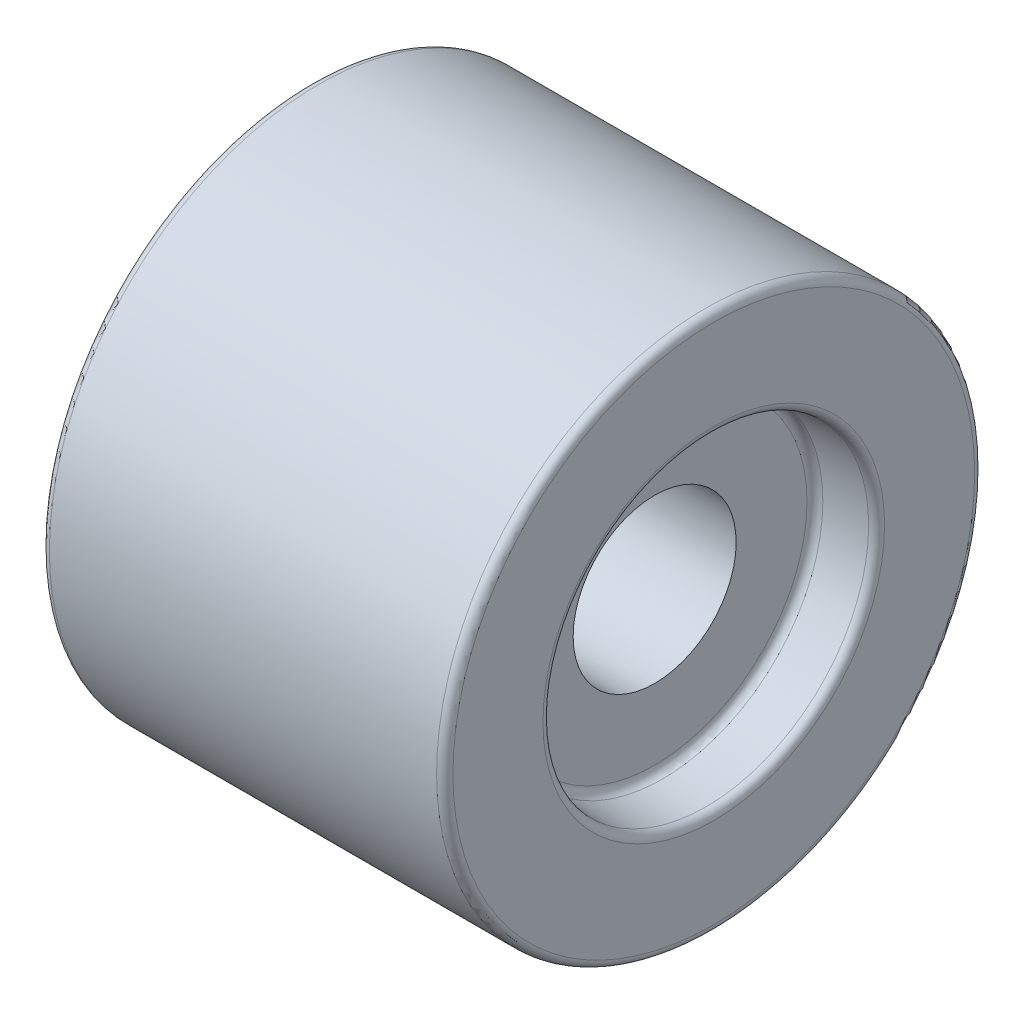
ISO-10303-21;
HEADER;
FILE_DESCRIPTION(('STEP AP214'),'2;1');
FILE_NAME('part.step','',(''),(''),'','','');
FILE_SCHEMA(('AUTOMOTIVE_DESIGN { 1 0 10303 214 1 1 1 1 }'));
ENDSEC;
DATA;
#1=APPLICATION_CONTEXT('core data for automotive mechanical design processes');
#2=APPLICATION_PROTOCOL_DEFINITION('international standard','automotive_design',2000,#1);
#3=PRODUCT_CONTEXT('',#1,'mechanical');
#4=PRODUCT('Part','Part','',(#3));
#5=PRODUCT_RELATED_PRODUCT_CATEGORY('part','',(#4));
#6=PRODUCT_DEFINITION_FORMATION('','',#4);
#7=PRODUCT_DEFINITION_CONTEXT('part definition',#1,'design');
#8=PRODUCT_DEFINITION('design','',#6,#7);
#9=PRODUCT_DEFINITION_SHAPE('','',#8);
#10=(LENGTH_UNIT() NAMED_UNIT(*) SI_UNIT(.MILLI.,.METRE.));
#11=(NAMED_UNIT(*) PLANE_ANGLE_UNIT() SI_UNIT($,.RADIAN.));
#12=(NAMED_UNIT(*) SI_UNIT($,.STERADIAN.) SOLID_ANGLE_UNIT());
#13=UNCERTAINTY_MEASURE_WITH_UNIT(LENGTH_MEASURE(1.E-05),#10,'distance_accuracy_value','');
#14=(GEOMETRIC_REPRESENTATION_CONTEXT(3) GLOBAL_UNCERTAINTY_ASSIGNED_CONTEXT((#13)) GLOBAL_UNIT_ASSIGNED_CONTEXT((#10,
#11,#12)) REPRESENTATION_CONTEXT('',''));
#15=CARTESIAN_POINT('',(0.,0.,0.));
#16=DIRECTION('',(0.,0.,1.));
#17=DIRECTION('',(1.,0.,0.));
#18=AXIS2_PLACEMENT_3D('',#15,#16,#17);
#19=CARTESIAN_POINT('',(49.5,66.,0.));
#20=DIRECTION('',(-1.,0.,0.));
#21=DIRECTION('',(0.,0.,1.));
#22=AXIS2_PLACEMENT_3D('',#19,#20,#21);
#23=PLANE('',#22);
#24=CARTESIAN_POINT('',(49.5,0.,0.));
#25=DIRECTION('',(-1.,0.,0.));
#26=DIRECTION('',(0.,0.,1.));
#27=AXIS2_PLACEMENT_3D('',#24,#25,#26);
#28=CIRCLE('',#27,41.9012489406435);
#29=CARTESIAN_POINT('',(49.5,0.,41.9012489406435));
#30=VERTEX_POINT('',#29);
#31=EDGE_CURVE('E41',#30,#30,#28,.T.);
#32=ORIENTED_EDGE('',*,*,#31,.T.);
#33=EDGE_LOOP('',(#32));
#34=FACE_BOUND('',#33,.T.);
#35=CARTESIAN_POINT('',(49.5,0.,0.));
#36=DIRECTION('',(-1.,0.,0.));
#37=DIRECTION('',(0.,0.,1.));
#38=AXIS2_PLACEMENT_3D('',#35,#36,#37);
#39=CIRCLE('',#38,64.);
#40=CARTESIAN_POINT('',(49.5,0.,64.));
#41=VERTEX_POINT('',#40);
#42=EDGE_CURVE('E46',#41,#41,#39,.F.);
#43=ORIENTED_EDGE('',*,*,#42,.T.);
#44=EDGE_LOOP('',(#43));
#45=FACE_BOUND('',#44,.T.);
#46=ADVANCED_FACE('F29',(#34,#45),#23,.F.);
#47=CARTESIAN_POINT('',(-49.5,66.,0.));
#48=DIRECTION('',(1.,0.,0.));
#49=DIRECTION('',(0.,0.,-1.));
#50=AXIS2_PLACEMENT_3D('',#47,#48,#49);
#51=PLANE('',#50);
#52=CARTESIAN_POINT('',(-49.5,0.,0.));
#53=DIRECTION('',(1.,0.,0.));
#54=DIRECTION('',(0.,0.,-1.));
#55=AXIS2_PLACEMENT_3D('',#52,#53,#54);
#56=CIRCLE('',#55,64.);
#57=CARTESIAN_POINT('',(-49.5,0.,-64.));
#58=VERTEX_POINT('',#57);
#59=EDGE_CURVE('E64',#58,#58,#56,.F.);
#60=ORIENTED_EDGE('',*,*,#59,.T.);
#61=EDGE_LOOP('',(#60));
#62=FACE_BOUND('',#61,.T.);
#63=CARTESIAN_POINT('',(-49.5,0.,0.));
#64=DIRECTION('',(-1.,0.,0.));
#65=DIRECTION('',(0.,0.,1.));
#66=AXIS2_PLACEMENT_3D('',#63,#64,#65);
#67=CIRCLE('',#66,40.);
#68=CARTESIAN_POINT('',(-49.5,0.,40.));
#69=VERTEX_POINT('',#68);
#70=EDGE_CURVE('E67',#69,#69,#67,.T.);
#71=ORIENTED_EDGE('',*,*,#70,.F.);
#72=EDGE_LOOP('',(#71));
#73=FACE_BOUND('',#72,.T.);
#74=ADVANCED_FACE('F108',(#62,#73),#51,.F.);
#75=CARTESIAN_POINT('',(-49.5,0.,0.));
#76=DIRECTION('',(-1.,0.,0.));
#77=DIRECTION('',(0.,0.,1.));
#78=AXIS2_PLACEMENT_3D('',#75,#76,#77);
#79=CYLINDRICAL_SURFACE('',#78,66.);
#80=CARTESIAN_POINT('',(-47.5,0.,0.));
#81=DIRECTION('',(1.,0.,0.));
#82=DIRECTION('',(0.,0.,-1.));
#83=AXIS2_PLACEMENT_3D('',#80,#81,#82);
#84=CIRCLE('',#83,66.);
#85=CARTESIAN_POINT('',(-47.5,0.,-66.));
#86=VERTEX_POINT('',#85);
#87=EDGE_CURVE('E58',#86,#86,#84,.T.);
#88=ORIENTED_EDGE('',*,*,#87,.T.);
#89=EDGE_LOOP('',(#88));
#90=FACE_BOUND('',#89,.T.);
#91=CARTESIAN_POINT('',(47.5,0.,0.));
#92=DIRECTION('',(-1.,0.,0.));
#93=DIRECTION('',(0.,0.,1.));
#94=AXIS2_PLACEMENT_3D('',#91,#92,#93);
#95=CIRCLE('',#94,66.);
#96=CARTESIAN_POINT('',(47.5,0.,66.));
#97=VERTEX_POINT('',#96);
#98=EDGE_CURVE('E61',#97,#97,#95,.T.);
#99=ORIENTED_EDGE('',*,*,#98,.T.);
#100=EDGE_LOOP('',(#99));
#101=FACE_BOUND('',#100,.T.);
#102=ADVANCED_FACE('F116',(#90,#101),#79,.T.);
#103=CARTESIAN_POINT('',(-49.5,0.,0.));
#104=DIRECTION('',(-1.,0.,0.));
#105=DIRECTION('',(0.,0.,1.));
#106=AXIS2_PLACEMENT_3D('',#103,#104,#105);
#107=CONICAL_SURFACE('',#106,40.,0.0506145483078357);
#108=CARTESIAN_POINT('',(-36.8988141198466,0.,0.));
#109=DIRECTION('',(1.,0.,0.));
#110=DIRECTION('',(0.,0.,-1.));
#111=AXIS2_PLACEMENT_3D('',#108,#109,#110);
#112=CIRCLE('',#111,39.3616514613999);
#113=CARTESIAN_POINT('',(-36.8988141198466,0.,-39.3616514613999));
#114=VERTEX_POINT('',#113);
#115=EDGE_CURVE('E10',#114,#114,#112,.T.);
#116=ORIENTED_EDGE('',*,*,#115,.T.);
#117=EDGE_LOOP('',(#116));
#118=FACE_BOUND('',#117,.T.);
#119=ORIENTED_EDGE('',*,*,#70,.T.);
#120=EDGE_LOOP('',(#119));
#121=FACE_BOUND('',#120,.T.);
#122=ADVANCED_FACE('F118',(#118,#121),#107,.F.);
#123=CARTESIAN_POINT('',(-35.,0.,0.));
#124=DIRECTION('',(-1.,0.,0.));
#125=DIRECTION('',(0.,0.,1.));
#126=AXIS2_PLACEMENT_3D('',#123,#124,#125);
#127=PLANE('',#126);
#128=CARTESIAN_POINT('',(-35.,0.,0.));
#129=DIRECTION('',(-1.,0.,0.));
#130=DIRECTION('',(0.,0.,1.));
#131=AXIS2_PLACEMENT_3D('',#128,#129,#130);
#132=CIRCLE('',#131,20.);
#133=CARTESIAN_POINT('',(-35.,0.,20.));
#134=VERTEX_POINT('',#133);
#135=EDGE_CURVE('E70',#134,#134,#132,.T.);
#136=ORIENTED_EDGE('',*,*,#135,.F.);
#137=EDGE_LOOP('',(#136));
#138=FACE_BOUND('',#137,.T.);
#139=CARTESIAN_POINT('',(-35.,0.,0.));
#140=DIRECTION('',(-1.,0.,0.));
#141=DIRECTION('',(0.,0.,1.));
#142=AXIS2_PLACEMENT_3D('',#139,#140,#141);
#143=CIRCLE('',#142,37.3642127470316);
#144=CARTESIAN_POINT('',(-35.,0.,37.3642127470316));
#145=VERTEX_POINT('',#144);
#146=EDGE_CURVE('E37',#145,#145,#143,.T.);
#147=ORIENTED_EDGE('',*,*,#146,.T.);
#148=EDGE_LOOP('',(#147));
#149=FACE_BOUND('',#148,.T.);
#150=ADVANCED_FACE('F96',(#138,#149),#127,.T.);
#151=CARTESIAN_POINT('',(49.5,0.,0.));
#152=DIRECTION('',(1.,0.,0.));
#153=DIRECTION('',(0.,0.,1.));
#154=AXIS2_PLACEMENT_3D('',#151,#152,#153);
#155=CONICAL_SURFACE('',#154,40.,0.0506145483078357);
#156=CARTESIAN_POINT('',(36.8988141198466,0.,0.));
#157=DIRECTION('',(1.,0.,0.));
#158=DIRECTION('',(0.,0.,-1.));
#159=AXIS2_PLACEMENT_3D('',#156,#157,#158);
#160=CIRCLE('',#159,39.3616514613999);
#161=CARTESIAN_POINT('',(36.8988141198466,0.,-39.3616514613999));
#162=VERTEX_POINT('',#161);
#163=EDGE_CURVE('E52',#162,#162,#160,.F.);
#164=ORIENTED_EDGE('',*,*,#163,.T.);
#165=EDGE_LOOP('',(#164));
#166=FACE_BOUND('',#165,.T.);
#167=CARTESIAN_POINT('',(47.6011858801534,0.,0.));
#168=DIRECTION('',(1.,0.,0.));
#169=DIRECTION('',(0.,0.,-1.));
#170=AXIS2_PLACEMENT_3D('',#167,#168,#169);
#171=CIRCLE('',#170,39.9038102262751);
#172=CARTESIAN_POINT('',(47.6011858801534,0.,-39.9038102262751));
#173=VERTEX_POINT('',#172);
#174=EDGE_CURVE('E55',#173,#173,#171,.T.);
#175=ORIENTED_EDGE('',*,*,#174,.T.);
#176=EDGE_LOOP('',(#175));
#177=FACE_BOUND('',#176,.T.);
#178=ADVANCED_FACE('F83',(#166,#177),#155,.F.);
#179=CARTESIAN_POINT('',(35.,0.,0.));
#180=DIRECTION('',(1.,0.,0.));
#181=DIRECTION('',(0.,0.,1.));
#182=AXIS2_PLACEMENT_3D('',#179,#180,#181);
#183=PLANE('',#182);
#184=CARTESIAN_POINT('',(35.,0.,0.));
#185=DIRECTION('',(1.,0.,0.));
#186=DIRECTION('',(0.,0.,-1.));
#187=AXIS2_PLACEMENT_3D('',#184,#185,#186);
#188=CIRCLE('',#187,20.);
#189=CARTESIAN_POINT('',(35.,0.,-20.));
#190=VERTEX_POINT('',#189);
#191=EDGE_CURVE('E33',#190,#190,#188,.T.);
#192=ORIENTED_EDGE('',*,*,#191,.F.);
#193=EDGE_LOOP('',(#192));
#194=FACE_BOUND('',#193,.T.);
#195=CARTESIAN_POINT('',(35.,0.,0.));
#196=DIRECTION('',(1.,0.,0.));
#197=DIRECTION('',(0.,0.,-1.));
#198=AXIS2_PLACEMENT_3D('',#195,#196,#197);
#199=CIRCLE('',#198,37.3642127470316);
#200=CARTESIAN_POINT('',(35.,0.,-37.3642127470316));
#201=VERTEX_POINT('',#200);
#202=EDGE_CURVE('E49',#201,#201,#199,.T.);
#203=ORIENTED_EDGE('',*,*,#202,.T.);
#204=EDGE_LOOP('',(#203));
#205=FACE_BOUND('',#204,.T.);
#206=ADVANCED_FACE('F79',(#194,#205),#183,.T.);
#207=CARTESIAN_POINT('',(-47.5,0.,0.));
#208=DIRECTION('',(1.,0.,0.));
#209=DIRECTION('',(0.,0.,-1.));
#210=AXIS2_PLACEMENT_3D('',#207,#208,#209);
#211=TOROIDAL_SURFACE('',#210,64.,2.);
#212=ORIENTED_EDGE('',*,*,#87,.F.);
#213=EDGE_LOOP('',(#212));
#214=FACE_BOUND('',#213,.T.);
#215=ORIENTED_EDGE('',*,*,#59,.F.);
#216=EDGE_LOOP('',(#215));
#217=FACE_BOUND('',#216,.T.);
#218=ADVANCED_FACE('F82',(#214,#217),#211,.T.);
#219=CARTESIAN_POINT('',(37.,0.,0.));
#220=DIRECTION('',(1.,0.,0.));
#221=DIRECTION('',(0.,0.,-1.));
#222=AXIS2_PLACEMENT_3D('',#219,#220,#221);
#223=TOROIDAL_SURFACE('',#222,37.3642127470316,2.);
#224=ORIENTED_EDGE('',*,*,#202,.F.);
#225=EDGE_LOOP('',(#224));
#226=FACE_BOUND('',#225,.T.);
#227=ORIENTED_EDGE('',*,*,#163,.F.);
#228=EDGE_LOOP('',(#227));
#229=FACE_BOUND('',#228,.T.);
#230=ADVANCED_FACE('F87',(#226,#229),#223,.F.);
#231=CARTESIAN_POINT('',(47.5,0.,0.));
#232=DIRECTION('',(-1.,0.,0.));
#233=DIRECTION('',(0.,0.,1.));
#234=AXIS2_PLACEMENT_3D('',#231,#232,#233);
#235=TOROIDAL_SURFACE('',#234,41.9012489406435,2.);
#236=ORIENTED_EDGE('',*,*,#174,.F.);
#237=EDGE_LOOP('',(#236));
#238=FACE_BOUND('',#237,.T.);
#239=ORIENTED_EDGE('',*,*,#31,.F.);
#240=EDGE_LOOP('',(#239));
#241=FACE_BOUND('',#240,.T.);
#242=ADVANCED_FACE('F90',(#238,#241),#235,.T.);
#243=CARTESIAN_POINT('',(47.5,0.,0.));
#244=DIRECTION('',(-1.,0.,0.));
#245=DIRECTION('',(0.,0.,1.));
#246=AXIS2_PLACEMENT_3D('',#243,#244,#245);
#247=TOROIDAL_SURFACE('',#246,64.,2.);
#248=ORIENTED_EDGE('',*,*,#42,.F.);
#249=EDGE_LOOP('',(#248));
#250=FACE_BOUND('',#249,.T.);
#251=ORIENTED_EDGE('',*,*,#98,.F.);
#252=EDGE_LOOP('',(#251));
#253=FACE_BOUND('',#252,.T.);
#254=ADVANCED_FACE('F102',(#250,#253),#247,.T.);
#255=CARTESIAN_POINT('',(-37.,0.,0.));
#256=DIRECTION('',(-1.,0.,0.));
#257=DIRECTION('',(0.,0.,1.));
#258=AXIS2_PLACEMENT_3D('',#255,#256,#257);
#259=TOROIDAL_SURFACE('',#258,37.3642127470316,2.);
#260=ORIENTED_EDGE('',*,*,#115,.F.);
#261=EDGE_LOOP('',(#260));
#262=FACE_BOUND('',#261,.T.);
#263=ORIENTED_EDGE('',*,*,#146,.F.);
#264=EDGE_LOOP('',(#263));
#265=FACE_BOUND('',#264,.T.);
#266=ADVANCED_FACE('F31',(#262,#265),#259,.F.);
#267=CARTESIAN_POINT('',(65.,0.,0.));
#268=DIRECTION('',(-1.,0.,0.));
#269=DIRECTION('',(0.,0.,1.));
#270=AXIS2_PLACEMENT_3D('',#267,#268,#269);
#271=CYLINDRICAL_SURFACE('',#270,20.);
#272=ORIENTED_EDGE('',*,*,#191,.T.);
#273=EDGE_LOOP('',(#272));
#274=FACE_BOUND('',#273,.T.);
#275=ORIENTED_EDGE('',*,*,#135,.T.);
#276=EDGE_LOOP('',(#275));
#277=FACE_BOUND('',#276,.T.);
#278=ADVANCED_FACE('F77',(#274,#277),#271,.F.);
#279=CLOSED_SHELL('',(#46,#74,#102,#122,#150,#178,#206,#218,#230,#242,#254,#266,#278));
#280=MANIFOLD_SOLID_BREP('B2',#279);
#281=ADVANCED_BREP_SHAPE_REPRESENTATION('',(#18,#280),#14);
#282=SHAPE_DEFINITION_REPRESENTATION(#9,#281);
ENDSEC;
END-ISO-10303-21;
